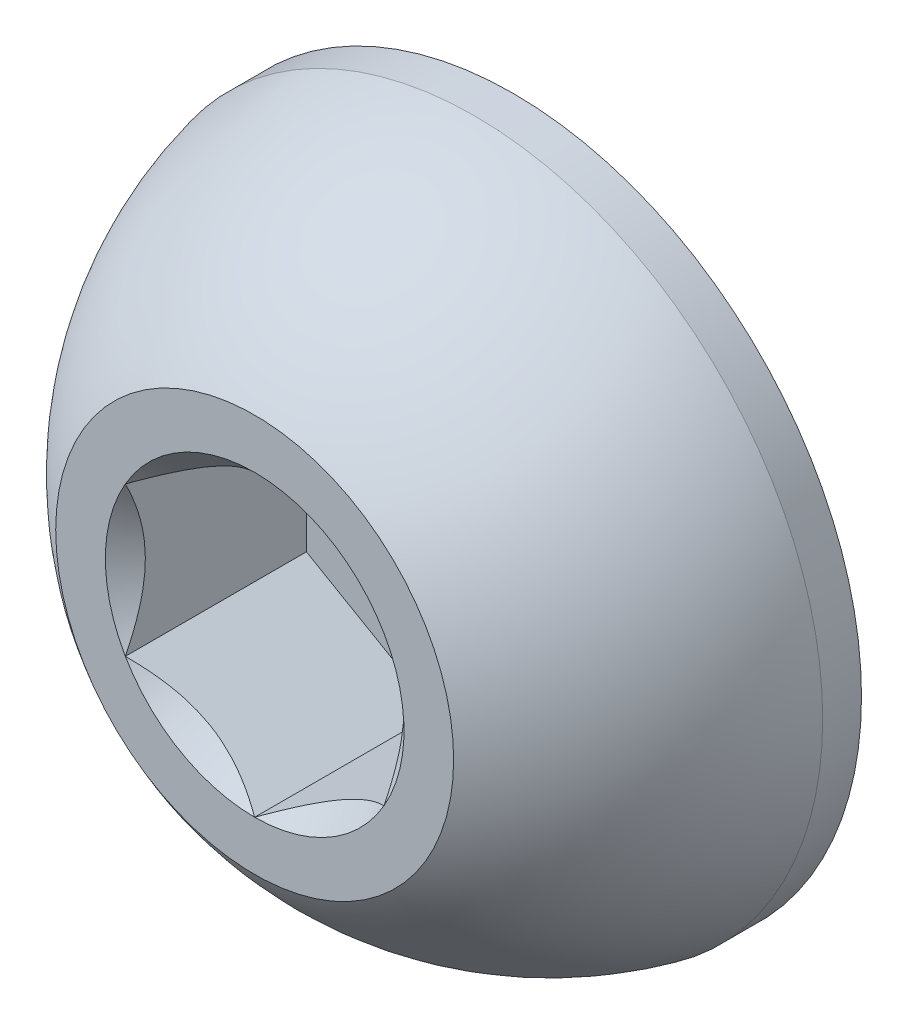
ISO-10303-21;
HEADER;
FILE_DESCRIPTION(('STEP AP214'),'2;1');
FILE_NAME('part.step','',(''),(''),'','','');
FILE_SCHEMA(('AUTOMOTIVE_DESIGN { 1 0 10303 214 1 1 1 1 }'));
ENDSEC;
DATA;
#1=APPLICATION_CONTEXT('core data for automotive mechanical design processes');
#2=APPLICATION_PROTOCOL_DEFINITION('international standard','automotive_design',2000,#1);
#3=PRODUCT_CONTEXT('',#1,'mechanical');
#4=PRODUCT('Part','Part','',(#3));
#5=PRODUCT_RELATED_PRODUCT_CATEGORY('part','',(#4));
#6=PRODUCT_DEFINITION_FORMATION('','',#4);
#7=PRODUCT_DEFINITION_CONTEXT('part definition',#1,'design');
#8=PRODUCT_DEFINITION('design','',#6,#7);
#9=PRODUCT_DEFINITION_SHAPE('','',#8);
#10=(LENGTH_UNIT() NAMED_UNIT(*) SI_UNIT(.MILLI.,.METRE.));
#11=(NAMED_UNIT(*) PLANE_ANGLE_UNIT() SI_UNIT($,.RADIAN.));
#12=(NAMED_UNIT(*) SI_UNIT($,.STERADIAN.) SOLID_ANGLE_UNIT());
#13=UNCERTAINTY_MEASURE_WITH_UNIT(LENGTH_MEASURE(1.E-05),#10,'distance_accuracy_value','');
#14=(GEOMETRIC_REPRESENTATION_CONTEXT(3) GLOBAL_UNCERTAINTY_ASSIGNED_CONTEXT((#13)) GLOBAL_UNIT_ASSIGNED_CONTEXT((#10,
#11,#12)) REPRESENTATION_CONTEXT('',''));
#15=CARTESIAN_POINT('',(0.,0.,0.));
#16=DIRECTION('',(0.,0.,1.));
#17=DIRECTION('',(1.,0.,0.));
#18=AXIS2_PLACEMENT_3D('',#15,#16,#17);
#19=CARTESIAN_POINT('',(0.,0.,-1.48575791855203));
#20=DIRECTION('',(0.,0.,1.));
#21=DIRECTION('',(0.,-1.,0.));
#22=AXIS2_PLACEMENT_3D('',#19,#20,#21);
#23=SPHERICAL_SURFACE('',#22,1.79094293391502);
#24=CARTESIAN_POINT('',(0.,0.,0.));
#25=DIRECTION('',(0.,0.,1.));
#26=DIRECTION('',(1.,0.,0.));
#27=AXIS2_PLACEMENT_3D('',#24,#25,#26);
#28=CIRCLE('',#27,1.00000000000001);
#29=CARTESIAN_POINT('',(1.00000000000001,0.,0.));
#30=VERTEX_POINT('',#29);
#31=EDGE_CURVE('E56',#30,#30,#28,.T.);
#32=ORIENTED_EDGE('',*,*,#31,.F.);
#33=EDGE_LOOP('',(#32));
#34=FACE_BOUND('',#33,.T.);
#35=CARTESIAN_POINT('',(0.,0.,-1.105));
#36=DIRECTION('',(0.,0.,1.));
#37=DIRECTION('',(1.,0.,0.));
#38=AXIS2_PLACEMENT_3D('',#35,#36,#37);
#39=CIRCLE('',#38,1.75);
#40=CARTESIAN_POINT('',(1.75,0.,-1.105));
#41=VERTEX_POINT('',#40);
#42=EDGE_CURVE('E170',#41,#41,#39,.T.);
#43=ORIENTED_EDGE('',*,*,#42,.T.);
#44=EDGE_LOOP('',(#43));
#45=FACE_BOUND('',#44,.T.);
#46=ADVANCED_FACE('F43',(#34,#45),#23,.T.);
#47=CARTESIAN_POINT('',(0.,-1.00000000000001,0.));
#48=DIRECTION('',(0.,0.,-1.));
#49=DIRECTION('',(-1.,0.,0.));
#50=AXIS2_PLACEMENT_3D('',#47,#48,#49);
#51=PLANE('',#50);
#52=CARTESIAN_POINT('',(0.,0.,0.));
#53=DIRECTION('',(0.,0.,1.));
#54=DIRECTION('',(1.,0.,0.));
#55=AXIS2_PLACEMENT_3D('',#52,#53,#54);
#56=CIRCLE('',#55,0.750555349946512);
#57=CARTESIAN_POINT('',(-0.649999999999998,0.375277674973256,0.));
#58=VERTEX_POINT('',#57);
#59=CARTESIAN_POINT('',(-0.649999999999997,-0.375277674973259,0.));
#60=VERTEX_POINT('',#59);
#61=EDGE_CURVE('E69',#58,#60,#56,.T.);
#62=ORIENTED_EDGE('',*,*,#61,.F.);
#63=CARTESIAN_POINT('',(0.,0.750555349946512,0.));
#64=VERTEX_POINT('',#63);
#65=EDGE_CURVE('E141',#64,#58,#56,.T.);
#66=ORIENTED_EDGE('',*,*,#65,.F.);
#67=CARTESIAN_POINT('',(0.65,0.375277674973254,0.));
#68=VERTEX_POINT('',#67);
#69=EDGE_CURVE('E138',#68,#64,#56,.T.);
#70=ORIENTED_EDGE('',*,*,#69,.F.);
#71=CARTESIAN_POINT('',(0.65,-0.375277674973254,0.));
#72=VERTEX_POINT('',#71);
#73=EDGE_CURVE('E109',#72,#68,#56,.T.);
#74=ORIENTED_EDGE('',*,*,#73,.F.);
#75=CARTESIAN_POINT('',(0.,-0.750555349946512,0.));
#76=VERTEX_POINT('',#75);
#77=EDGE_CURVE('E101',#76,#72,#56,.T.);
#78=ORIENTED_EDGE('',*,*,#77,.F.);
#79=EDGE_CURVE('E62',#60,#76,#56,.T.);
#80=ORIENTED_EDGE('',*,*,#79,.F.);
#81=EDGE_LOOP('',(#62,#66,#70,#74,#78,#80));
#82=FACE_BOUND('',#81,.T.);
#83=ORIENTED_EDGE('',*,*,#31,.T.);
#84=EDGE_LOOP('',(#83));
#85=FACE_BOUND('',#84,.T.);
#86=ADVANCED_FACE('F135',(#82,#85),#51,.F.);
#87=CARTESIAN_POINT('',(0.,-1.75,-1.3));
#88=DIRECTION('',(0.,0.,1.));
#89=DIRECTION('',(1.,0.,0.));
#90=AXIS2_PLACEMENT_3D('',#87,#88,#89);
#91=PLANE('',#90);
#92=CARTESIAN_POINT('',(0.,0.,-1.3));
#93=DIRECTION('',(0.,0.,1.));
#94=DIRECTION('',(1.,0.,0.));
#95=AXIS2_PLACEMENT_3D('',#92,#93,#94);
#96=CIRCLE('',#95,1.75);
#97=CARTESIAN_POINT('',(1.75,0.,-1.3));
#98=VERTEX_POINT('',#97);
#99=EDGE_CURVE('E173',#98,#98,#96,.T.);
#100=ORIENTED_EDGE('',*,*,#99,.F.);
#101=EDGE_LOOP('',(#100));
#102=FACE_BOUND('',#101,.T.);
#103=ADVANCED_FACE('F185',(#102),#91,.F.);
#104=CARTESIAN_POINT('',(0.,0.,0.));
#105=DIRECTION('',(0.,0.,1.));
#106=DIRECTION('',(1.,0.,0.));
#107=AXIS2_PLACEMENT_3D('',#104,#105,#106);
#108=CYLINDRICAL_SURFACE('',#107,1.75);
#109=ORIENTED_EDGE('',*,*,#42,.F.);
#110=EDGE_LOOP('',(#109));
#111=FACE_BOUND('',#110,.T.);
#112=ORIENTED_EDGE('',*,*,#99,.T.);
#113=EDGE_LOOP('',(#112));
#114=FACE_BOUND('',#113,.T.);
#115=ADVANCED_FACE('F182',(#111,#114),#108,.T.);
#116=CARTESIAN_POINT('',(0.,0.,0.));
#117=DIRECTION('',(0.,0.,1.));
#118=DIRECTION('',(1.,0.,0.));
#119=AXIS2_PLACEMENT_3D('',#116,#117,#118);
#120=CONICAL_SURFACE('',#119,0.750555349946512,0.78539816339745);
#121=ORIENTED_EDGE('',*,*,#73,.T.);
#122=CARTESIAN_POINT('',(0.65,-0.748456856201993,0.240750690384005));
#123=CARTESIAN_POINT('',(0.65,-0.711991073878816,0.213280285933621));
#124=CARTESIAN_POINT('',(0.65,-0.675139640082794,0.186265195476194));
#125=CARTESIAN_POINT('',(0.65,-0.600031183452819,0.133629348283163));
#126=CARTESIAN_POINT('',(0.65,-0.561765441270894,0.108021106129097));
#127=CARTESIAN_POINT('',(0.65,-0.481525479406319,0.0577374937624613));
#128=CARTESIAN_POINT('',(0.65,-0.439464253670484,0.0331988021987558));
#129=CARTESIAN_POINT('',(0.65,-0.353242719412717,-0.0116853403013637));
#130=CARTESIAN_POINT('',(0.65,-0.309090130602523,-0.0320449275105113));
#131=CARTESIAN_POINT('',(0.65,-0.242810057498668,-0.0569512709113473));
#132=CARTESIAN_POINT('',(0.65,-0.221667349821687,-0.0640992725852869));
#133=CARTESIAN_POINT('',(0.65,-0.178882845085541,-0.0767024705474531));
#134=CARTESIAN_POINT('',(0.65,-0.157241013753962,-0.0821575502168733));
#135=CARTESIAN_POINT('',(0.65,-0.0924732258239327,-0.0953392346897749));
#136=CARTESIAN_POINT('',(0.65,-0.0486986201802761,-0.100206440230559));
#137=CARTESIAN_POINT('',(0.65,0.0373331587621249,-0.10085551076922));
#138=CARTESIAN_POINT('',(0.65,0.0795879418799275,-0.0969596606801929));
#139=CARTESIAN_POINT('',(0.65,0.142230570834976,-0.0855076744021655));
#140=CARTESIAN_POINT('',(0.65,0.163174856664669,-0.080685435763269));
#141=CARTESIAN_POINT('',(0.65,0.204615212735414,-0.0693999000452562));
#142=CARTESIAN_POINT('',(0.65,0.225111320324617,-0.0629367402798553));
#143=CARTESIAN_POINT('',(0.65,0.289638534772371,-0.0401559078683569));
#144=CARTESIAN_POINT('',(0.65,0.332748206875051,-0.0212427548657985));
#145=CARTESIAN_POINT('',(0.65,0.416943840013234,0.0208112818887808));
#146=CARTESIAN_POINT('',(0.65,0.45802183453077,0.0439673547577785));
#147=CARTESIAN_POINT('',(0.65,0.53652923324599,0.0917266397180912));
#148=CARTESIAN_POINT('',(0.65,0.574038509134623,0.116200758127156));
#149=CARTESIAN_POINT('',(0.65,0.647609691485458,0.166623456014885));
#150=CARTESIAN_POINT('',(0.65,0.683680924535921,0.192558343655291));
#151=CARTESIAN_POINT('',(0.65,0.719356204751142,0.218966877397434));
#152=B_SPLINE_CURVE_WITH_KNOTS('',3,(#122,#123,#124,#125,#126,#127,#128,#129,#130,#131,#132,
#133,#134,#135,#136,#137,#138,#139,#140,#141,#142,#143,#144,#145,#146,#147,#148,#149,#150,#151),
.UNSPECIFIED.,.F.,.F.,(4,2,2,2,2,2,2,2,2,2,2,2,2,2,4),(0.,0.137014030009578,0.275096405762551,
0.421060359835522,0.566522128775089,0.633415056462916,0.7003125911218,0.831534924508334,
0.958010408789896,1.02242898521265,1.08684217280828,1.22766018796412,1.36899252873703,
1.50330165960873,1.63651263433843),.UNSPECIFIED.);
#153=EDGE_CURVE('E11',#72,#68,#152,.T.);
#154=ORIENTED_EDGE('',*,*,#153,.F.);
#155=EDGE_LOOP('',(#121,#154));
#156=FACE_BOUND('',#155,.T.);
#157=ADVANCED_FACE('F113',(#156),#120,.F.);
#158=ORIENTED_EDGE('',*,*,#69,.T.);
#159=CARTESIAN_POINT('',(0.6502,0.375162204919418,0.000115496696675192));
#160=CARTESIAN_POINT('',(0.62784612455738,0.388068220923646,-0.0127826378084528));
#161=CARTESIAN_POINT('',(0.605119879467388,0.401189224644023,-0.0249248451013623));
#162=CARTESIAN_POINT('',(0.558778015356718,0.427944712363067,-0.0471577551377729));
#163=CARTESIAN_POINT('',(0.535157980959404,0.441581745580624,-0.0572360751899923));
#164=CARTESIAN_POINT('',(0.487526191293144,0.469081972166423,-0.0744984835766245));
#165=CARTESIAN_POINT('',(0.463526635406914,0.482938122217769,-0.08172604148442));
#166=CARTESIAN_POINT('',(0.415010589754791,0.510948874235039,-0.0928707979999926));
#167=CARTESIAN_POINT('',(0.390495555958119,0.52510263559674,-0.0967962973781314));
#168=CARTESIAN_POINT('',(0.33061559766408,0.559674345636867,-0.101776562665292));
#169=CARTESIAN_POINT('',(0.295110807096765,0.580173046028428,-0.100875515207341));
#170=CARTESIAN_POINT('',(0.224845447682006,0.620740770201245,-0.0915914386833307));
#171=CARTESIAN_POINT('',(0.190086069560699,0.640809106516445,-0.083197236970343));
#172=CARTESIAN_POINT('',(0.129041737491061,0.676053068069352,-0.0629543214927018));
#173=CARTESIAN_POINT('',(0.102476138584915,0.691390723748998,-0.0521615767354971));
#174=CARTESIAN_POINT('',(0.0503858451009338,0.721465068714142,-0.0278480685503981));
#175=CARTESIAN_POINT('',(0.0248580811749648,0.736203530088609,-0.0143361789927107));
#176=CARTESIAN_POINT('',(-0.000199999999999354,0.75067082000035,0.000115496696673986));
#177=B_SPLINE_CURVE_WITH_KNOTS('',3,(#159,#160,#161,#162,#163,#164,#165,#166,#167,#168,#169,
#170,#171,#172,#173,#174,#175,#176),.UNSPECIFIED.,.F.,.F.,(4,2,2,2,2,2,2,2,4),(0.,
0.0866236559063445,0.173752711623243,0.259496442803569,0.345023980281753,0.467267720550126,
0.589694037029336,0.687111308755481,0.784215671813665),.UNSPECIFIED.);
#178=EDGE_CURVE('E140',#68,#64,#177,.T.);
#179=ORIENTED_EDGE('',*,*,#178,.F.);
#180=EDGE_LOOP('',(#158,#179));
#181=FACE_BOUND('',#180,.T.);
#182=ADVANCED_FACE('F275',(#181),#120,.F.);
#183=ORIENTED_EDGE('',*,*,#65,.T.);
#184=CARTESIAN_POINT('',(0.000200000000000687,0.75067082000035,0.000115496696674086));
#185=CARTESIAN_POINT('',(-0.0221538754426199,0.737764803996122,-0.0127826378084537));
#186=CARTESIAN_POINT('',(-0.0448801205326119,0.724643800275746,-0.0249248451013632));
#187=CARTESIAN_POINT('',(-0.0912219846432817,0.697888312556701,-0.0471577551377739));
#188=CARTESIAN_POINT('',(-0.114842019040596,0.684251279339144,-0.0572360751899933));
#189=CARTESIAN_POINT('',(-0.162473808706855,0.656751052753345,-0.0744984835766254));
#190=CARTESIAN_POINT('',(-0.186473364593085,0.642894902701999,-0.0817260414844208));
#191=CARTESIAN_POINT('',(-0.234989410245209,0.614884150684729,-0.0928707979999933));
#192=CARTESIAN_POINT('',(-0.25950444404188,0.600730389323028,-0.0967962973781321));
#193=CARTESIAN_POINT('',(-0.319384402335919,0.566158679282901,-0.101776562665293));
#194=CARTESIAN_POINT('',(-0.354889192903234,0.545659978891341,-0.100875515207342));
#195=CARTESIAN_POINT('',(-0.425154552317993,0.505092254718524,-0.0915914386833313));
#196=CARTESIAN_POINT('',(-0.4599139304393,0.485023918403323,-0.0831972369703435));
#197=CARTESIAN_POINT('',(-0.520958262508938,0.449779956850417,-0.0629543214927024));
#198=CARTESIAN_POINT('',(-0.547523861415084,0.43444230117077,-0.0521615767354977));
#199=CARTESIAN_POINT('',(-0.599614154899065,0.404367956205627,-0.0278480685503987));
#200=CARTESIAN_POINT('',(-0.625141918825034,0.389629494831159,-0.0143361789927112));
#201=CARTESIAN_POINT('',(-0.650199999999998,0.375162204919418,0.0001154966966736));
#202=B_SPLINE_CURVE_WITH_KNOTS('',3,(#184,#185,#186,#187,#188,#189,#190,#191,#192,#193,#194,
#195,#196,#197,#198,#199,#200,#201),.UNSPECIFIED.,.F.,.F.,(4,2,2,2,2,2,2,2,4),(0.,
0.0866236559063444,0.173752711623242,0.259496442803568,0.345023980281752,0.467267720550125,
0.589694037029335,0.68711130875548,0.784215671813665),.UNSPECIFIED.);
#203=EDGE_CURVE('E145',#64,#58,#202,.T.);
#204=ORIENTED_EDGE('',*,*,#203,.F.);
#205=EDGE_LOOP('',(#183,#204));
#206=FACE_BOUND('',#205,.T.);
#207=ADVANCED_FACE('F148',(#206),#120,.F.);
#208=ORIENTED_EDGE('',*,*,#61,.T.);
#209=CARTESIAN_POINT('',(-0.649999999999997,-0.748456856202,0.240750690384008));
#210=CARTESIAN_POINT('',(-0.649999999999997,-0.711991073878822,0.213280285933623));
#211=CARTESIAN_POINT('',(-0.649999999999997,-0.6751396400828,0.186265195476196));
#212=CARTESIAN_POINT('',(-0.649999999999997,-0.600031183452825,0.133629348283164));
#213=CARTESIAN_POINT('',(-0.649999999999997,-0.561765441270899,0.108021106129098));
#214=CARTESIAN_POINT('',(-0.649999999999997,-0.481525479406324,0.0577374937624617));
#215=CARTESIAN_POINT('',(-0.649999999999997,-0.439464253670489,0.0331988021987558));
#216=CARTESIAN_POINT('',(-0.649999999999997,-0.353242719412722,-0.0116853403013644));
#217=CARTESIAN_POINT('',(-0.649999999999997,-0.309090130602527,-0.0320449275105122));
#218=CARTESIAN_POINT('',(-0.649999999999997,-0.242810057498671,-0.0569512709113487));
#219=CARTESIAN_POINT('',(-0.649999999999998,-0.221667349821691,-0.0640992725852885));
#220=CARTESIAN_POINT('',(-0.649999999999998,-0.178882845085544,-0.076702470547455));
#221=CARTESIAN_POINT('',(-0.649999999999998,-0.157241013753965,-0.0821575502168752));
#222=CARTESIAN_POINT('',(-0.649999999999998,-0.092473225823936,-0.0953392346897771));
#223=CARTESIAN_POINT('',(-0.649999999999998,-0.0486986201802792,-0.100206440230561));
#224=CARTESIAN_POINT('',(-0.649999999999998,0.0373331587621221,-0.100855510769223));
#225=CARTESIAN_POINT('',(-0.649999999999998,0.0795879418799249,-0.0969596606801957));
#226=CARTESIAN_POINT('',(-0.649999999999998,0.142230570834973,-0.0855076744021684));
#227=CARTESIAN_POINT('',(-0.649999999999998,0.163174856664667,-0.080685435763272));
#228=CARTESIAN_POINT('',(-0.649999999999998,0.204615212735411,-0.0693999000452592));
#229=CARTESIAN_POINT('',(-0.649999999999998,0.225111320324615,-0.0629367402798583));
#230=CARTESIAN_POINT('',(-0.649999999999998,0.289638534772368,-0.0401559078683601));
#231=CARTESIAN_POINT('',(-0.649999999999998,0.332748206875048,-0.0212427548658018));
#232=CARTESIAN_POINT('',(-0.649999999999998,0.41694384001323,0.0208112818887772));
#233=CARTESIAN_POINT('',(-0.649999999999998,0.458021834530766,0.0439673547577745));
#234=CARTESIAN_POINT('',(-0.649999999999998,0.536529233245986,0.0917266397180868));
#235=CARTESIAN_POINT('',(-0.649999999999998,0.574038509134618,0.116200758127151));
#236=CARTESIAN_POINT('',(-0.649999999999999,0.647609691485453,0.166623456014881));
#237=CARTESIAN_POINT('',(-0.649999999999999,0.683680924535915,0.192558343655286));
#238=CARTESIAN_POINT('',(-0.649999999999999,0.719356204751137,0.218966877397429));
#239=B_SPLINE_CURVE_WITH_KNOTS('',3,(#209,#210,#211,#212,#213,#214,#215,#216,#217,#218,#219,
#220,#221,#222,#223,#224,#225,#226,#227,#228,#229,#230,#231,#232,#233,#234,#235,#236,#237,#238),
.UNSPECIFIED.,.F.,.F.,(4,2,2,2,2,2,2,2,2,2,2,2,2,2,4),(0.,0.13701403000958,0.275096405762553,
0.421060359835525,0.566522128775094,0.633415056462921,0.700312591121805,0.83153492450834,
0.958010408789902,1.02242898521266,1.08684217280828,1.22766018796413,1.36899252873703,
1.50330165960873,1.63651263433843),.UNSPECIFIED.);
#240=EDGE_CURVE('E152',#58,#60,#239,.F.);
#241=ORIENTED_EDGE('',*,*,#240,.F.);
#242=EDGE_LOOP('',(#208,#241));
#243=FACE_BOUND('',#242,.T.);
#244=ADVANCED_FACE('F269',(#243),#120,.F.);
#245=ORIENTED_EDGE('',*,*,#79,.T.);
#246=CARTESIAN_POINT('',(-0.650199999999997,-0.375162204919418,0.000115496696672807));
#247=CARTESIAN_POINT('',(-0.627846124557377,-0.388068220923647,-0.0127826378084549));
#248=CARTESIAN_POINT('',(-0.605119879467385,-0.401189224644023,-0.0249248451013643));
#249=CARTESIAN_POINT('',(-0.558778015356716,-0.427944712363067,-0.0471577551377746));
#250=CARTESIAN_POINT('',(-0.535157980959402,-0.441581745580625,-0.0572360751899938));
#251=CARTESIAN_POINT('',(-0.487526191293143,-0.469081972166423,-0.0744984835766257));
#252=CARTESIAN_POINT('',(-0.463526635406913,-0.482938122217769,-0.081726041484421));
#253=CARTESIAN_POINT('',(-0.41501058975479,-0.510948874235039,-0.0928707979999934));
#254=CARTESIAN_POINT('',(-0.390495555958118,-0.52510263559674,-0.096796297378132));
#255=CARTESIAN_POINT('',(-0.33061559766408,-0.559674345636867,-0.101776562665293));
#256=CARTESIAN_POINT('',(-0.295110807096765,-0.580173046028428,-0.100875515207342));
#257=CARTESIAN_POINT('',(-0.224845447682006,-0.620740770201245,-0.0915914386833309));
#258=CARTESIAN_POINT('',(-0.190086069560699,-0.640809106516445,-0.0831972369703432));
#259=CARTESIAN_POINT('',(-0.129041737491061,-0.676053068069351,-0.062954321492702));
#260=CARTESIAN_POINT('',(-0.102476138584916,-0.691390723748998,-0.0521615767354973));
#261=CARTESIAN_POINT('',(-0.0503858451009351,-0.721465068714141,-0.0278480685503986));
#262=CARTESIAN_POINT('',(-0.0248580811749664,-0.736203530088608,-0.0143361789927113));
#263=CARTESIAN_POINT('',(0.00019999999999743,-0.750670820000349,0.000115496696673118));
#264=B_SPLINE_CURVE_WITH_KNOTS('',3,(#246,#247,#248,#249,#250,#251,#252,#253,#254,#255,#256,
#257,#258,#259,#260,#261,#262,#263),.UNSPECIFIED.,.F.,.F.,(4,2,2,2,2,2,2,2,4),(0.,
0.0866236559063438,0.173752711623241,0.259496442803566,0.34502398028175,0.467267720550123,
0.589694037029333,0.687111308755476,0.78421567181366),.UNSPECIFIED.);
#265=EDGE_CURVE('E125',#60,#76,#264,.T.);
#266=ORIENTED_EDGE('',*,*,#265,.F.);
#267=EDGE_LOOP('',(#245,#266));
#268=FACE_BOUND('',#267,.T.);
#269=ADVANCED_FACE('F217',(#268),#120,.F.);
#270=ORIENTED_EDGE('',*,*,#77,.T.);
#271=CARTESIAN_POINT('',(-0.000200000000002532,-0.750670820000349,0.000115496696673219));
#272=CARTESIAN_POINT('',(0.0221538754426182,-0.737764803996121,-0.0127826378084547));
#273=CARTESIAN_POINT('',(0.0448801205326102,-0.724643800275745,-0.0249248451013643));
#274=CARTESIAN_POINT('',(0.0912219846432802,-0.6978883125567,-0.0471577551377752));
#275=CARTESIAN_POINT('',(0.114842019040594,-0.684251279339143,-0.0572360751899947));
#276=CARTESIAN_POINT('',(0.162473808706854,-0.656751052753344,-0.074498483576627));
#277=CARTESIAN_POINT('',(0.186473364593084,-0.642894902701998,-0.0817260414844226));
#278=CARTESIAN_POINT('',(0.234989410245208,-0.614884150684728,-0.0928707979999952));
#279=CARTESIAN_POINT('',(0.259504444041879,-0.600730389323027,-0.0967962973781341));
#280=CARTESIAN_POINT('',(0.319384402335918,-0.5661586792829,-0.101776562665295));
#281=CARTESIAN_POINT('',(0.354889192903233,-0.545659978891339,-0.100875515207344));
#282=CARTESIAN_POINT('',(0.425154552317992,-0.505092254718522,-0.0915914386833333));
#283=CARTESIAN_POINT('',(0.459913930439299,-0.485023918403322,-0.0831972369703457));
#284=CARTESIAN_POINT('',(0.520958262508937,-0.449779956850415,-0.0629543214927043));
#285=CARTESIAN_POINT('',(0.547523861415084,-0.434442301170768,-0.0521615767354993));
#286=CARTESIAN_POINT('',(0.599614154899066,-0.404367956205624,-0.0278480685503996));
#287=CARTESIAN_POINT('',(0.625141918825036,-0.389629494831156,-0.0143361789927117));
#288=CARTESIAN_POINT('',(0.6502,-0.375162204919414,0.000115496696673408));
#289=B_SPLINE_CURVE_WITH_KNOTS('',3,(#271,#272,#273,#274,#275,#276,#277,#278,#279,#280,#281,
#282,#283,#284,#285,#286,#287,#288),.UNSPECIFIED.,.F.,.F.,(4,2,2,2,2,2,2,2,4),(0.,
0.0866236559063447,0.173752711623243,0.259496442803569,0.345023980281754,0.467267720550126,
0.589694037029336,0.687111308755483,0.78421567181367),.UNSPECIFIED.);
#290=EDGE_CURVE('E105',#76,#72,#289,.T.);
#291=ORIENTED_EDGE('',*,*,#290,.F.);
#292=EDGE_LOOP('',(#270,#291));
#293=FACE_BOUND('',#292,.T.);
#294=ADVANCED_FACE('F103',(#293),#120,.F.);
#295=CARTESIAN_POINT('',(0.65,-0.375277674973252,-0.91));
#296=DIRECTION('',(0.,0.,1.));
#297=DIRECTION('',(1.,0.,0.));
#298=AXIS2_PLACEMENT_3D('',#295,#296,#297);
#299=PLANE('',#298);
#300=DIRECTION('',(0.866025403784438,0.5,0.));
#301=VECTOR('',#300,1.);
#302=CARTESIAN_POINT('',(0.,-0.750555349946511,-0.91));
#303=LINE('',#302,#301);
#304=CARTESIAN_POINT('',(0.,-0.750555349946511,-0.91));
#305=VERTEX_POINT('',#304);
#306=CARTESIAN_POINT('',(0.65,-0.375277674973252,-0.91));
#307=VERTEX_POINT('',#306);
#308=EDGE_CURVE('E124',#305,#307,#303,.T.);
#309=ORIENTED_EDGE('',*,*,#308,.T.);
#310=DIRECTION('',(0.,1.,0.));
#311=VECTOR('',#310,1.);
#312=CARTESIAN_POINT('',(0.65,-0.375277674973252,-0.91));
#313=LINE('',#312,#311);
#314=CARTESIAN_POINT('',(0.65,0.375277674973256,-0.91));
#315=VERTEX_POINT('',#314);
#316=EDGE_CURVE('E129',#307,#315,#313,.T.);
#317=ORIENTED_EDGE('',*,*,#316,.T.);
#318=DIRECTION('',(-0.866025403784439,0.5,0.));
#319=VECTOR('',#318,1.);
#320=CARTESIAN_POINT('',(0.65,0.375277674973256,-0.91));
#321=LINE('',#320,#319);
#322=CARTESIAN_POINT('',(0.,0.750555349946512,-0.91));
#323=VERTEX_POINT('',#322);
#324=EDGE_CURVE('E259',#315,#323,#321,.T.);
#325=ORIENTED_EDGE('',*,*,#324,.T.);
#326=DIRECTION('',(-0.866025403784439,-0.5,0.));
#327=VECTOR('',#326,1.);
#328=CARTESIAN_POINT('',(0.,0.750555349946512,-0.91));
#329=LINE('',#328,#327);
#330=CARTESIAN_POINT('',(-0.649999999999998,0.375277674973256,-0.91));
#331=VERTEX_POINT('',#330);
#332=EDGE_CURVE('E161',#323,#331,#329,.T.);
#333=ORIENTED_EDGE('',*,*,#332,.T.);
#334=DIRECTION('',(0.,-1.,0.));
#335=VECTOR('',#334,1.);
#336=CARTESIAN_POINT('',(-0.649999999999998,0.375277674973256,-0.91));
#337=LINE('',#336,#335);
#338=CARTESIAN_POINT('',(-0.649999999999997,-0.375277674973256,-0.91));
#339=VERTEX_POINT('',#338);
#340=EDGE_CURVE('E263',#331,#339,#337,.T.);
#341=ORIENTED_EDGE('',*,*,#340,.T.);
#342=DIRECTION('',(0.866025403784438,-0.500000000000001,0.));
#343=VECTOR('',#342,1.);
#344=CARTESIAN_POINT('',(-0.649999999999997,-0.375277674973256,-0.91));
#345=LINE('',#344,#343);
#346=EDGE_CURVE('E132',#339,#305,#345,.T.);
#347=ORIENTED_EDGE('',*,*,#346,.T.);
#348=EDGE_LOOP('',(#309,#317,#325,#333,#341,#347));
#349=FACE_BOUND('',#348,.T.);
#350=ADVANCED_FACE('F216',(#349),#299,.T.);
#351=CARTESIAN_POINT('',(0.65,-0.375277674973252,-0.91));
#352=DIRECTION('',(1.,0.,0.));
#353=DIRECTION('',(0.,0.,-1.));
#354=AXIS2_PLACEMENT_3D('',#351,#352,#353);
#355=PLANE('',#354);
#356=DIRECTION('',(0.,0.,1.));
#357=VECTOR('',#356,1.);
#358=CARTESIAN_POINT('',(0.65,-0.375277674973252,-0.91));
#359=LINE('',#358,#357);
#360=EDGE_CURVE('E121',#307,#72,#359,.T.);
#361=ORIENTED_EDGE('',*,*,#360,.T.);
#362=ORIENTED_EDGE('',*,*,#153,.T.);
#363=DIRECTION('',(0.,0.,1.));
#364=VECTOR('',#363,1.);
#365=CARTESIAN_POINT('',(0.65,0.375277674973256,-0.91));
#366=LINE('',#365,#364);
#367=EDGE_CURVE('E131',#315,#68,#366,.T.);
#368=ORIENTED_EDGE('',*,*,#367,.F.);
#369=ORIENTED_EDGE('',*,*,#316,.F.);
#370=EDGE_LOOP('',(#361,#362,#368,#369));
#371=FACE_BOUND('',#370,.T.);
#372=ADVANCED_FACE('F127',(#371),#355,.F.);
#373=CARTESIAN_POINT('',(0.65,0.375277674973256,-0.91));
#374=DIRECTION('',(0.5,0.866025403784439,0.));
#375=DIRECTION('',(-0.866025403784439,0.5,0.));
#376=AXIS2_PLACEMENT_3D('',#373,#374,#375);
#377=PLANE('',#376);
#378=ORIENTED_EDGE('',*,*,#367,.T.);
#379=ORIENTED_EDGE('',*,*,#178,.T.);
#380=DIRECTION('',(0.,0.,1.));
#381=VECTOR('',#380,1.);
#382=CARTESIAN_POINT('',(0.,0.750555349946512,-0.91));
#383=LINE('',#382,#381);
#384=EDGE_CURVE('E157',#323,#64,#383,.T.);
#385=ORIENTED_EDGE('',*,*,#384,.F.);
#386=ORIENTED_EDGE('',*,*,#324,.F.);
#387=EDGE_LOOP('',(#378,#379,#385,#386));
#388=FACE_BOUND('',#387,.T.);
#389=ADVANCED_FACE('F155',(#388),#377,.F.);
#390=CARTESIAN_POINT('',(0.,0.750555349946512,-0.91));
#391=DIRECTION('',(-0.5,0.866025403784439,0.));
#392=DIRECTION('',(-0.866025403784439,-0.5,0.));
#393=AXIS2_PLACEMENT_3D('',#390,#391,#392);
#394=PLANE('',#393);
#395=ORIENTED_EDGE('',*,*,#384,.T.);
#396=ORIENTED_EDGE('',*,*,#203,.T.);
#397=DIRECTION('',(0.,0.,1.));
#398=VECTOR('',#397,1.);
#399=CARTESIAN_POINT('',(-0.649999999999998,0.375277674973256,-0.91));
#400=LINE('',#399,#398);
#401=EDGE_CURVE('E163',#331,#58,#400,.T.);
#402=ORIENTED_EDGE('',*,*,#401,.F.);
#403=ORIENTED_EDGE('',*,*,#332,.F.);
#404=EDGE_LOOP('',(#395,#396,#402,#403));
#405=FACE_BOUND('',#404,.T.);
#406=ADVANCED_FACE('F159',(#405),#394,.F.);
#407=CARTESIAN_POINT('',(-0.649999999999998,0.375277674973256,-0.91));
#408=DIRECTION('',(-1.,0.,0.));
#409=DIRECTION('',(0.,-1.,0.));
#410=AXIS2_PLACEMENT_3D('',#407,#408,#409);
#411=PLANE('',#410);
#412=ORIENTED_EDGE('',*,*,#401,.T.);
#413=ORIENTED_EDGE('',*,*,#240,.T.);
#414=DIRECTION('',(0.,0.,1.));
#415=VECTOR('',#414,1.);
#416=CARTESIAN_POINT('',(-0.649999999999997,-0.375277674973256,-0.91));
#417=LINE('',#416,#415);
#418=EDGE_CURVE('E165',#339,#60,#417,.T.);
#419=ORIENTED_EDGE('',*,*,#418,.F.);
#420=ORIENTED_EDGE('',*,*,#340,.F.);
#421=EDGE_LOOP('',(#412,#413,#419,#420));
#422=FACE_BOUND('',#421,.T.);
#423=ADVANCED_FACE('F238',(#422),#411,.F.);
#424=CARTESIAN_POINT('',(-0.649999999999997,-0.375277674973256,-0.91));
#425=DIRECTION('',(-0.500000000000001,-0.866025403784438,0.));
#426=DIRECTION('',(0.866025403784438,-0.500000000000001,0.));
#427=AXIS2_PLACEMENT_3D('',#424,#425,#426);
#428=PLANE('',#427);
#429=ORIENTED_EDGE('',*,*,#418,.T.);
#430=ORIENTED_EDGE('',*,*,#265,.T.);
#431=DIRECTION('',(0.,0.,1.));
#432=VECTOR('',#431,1.);
#433=CARTESIAN_POINT('',(0.,-0.750555349946511,-0.91));
#434=LINE('',#433,#432);
#435=EDGE_CURVE('E123',#305,#76,#434,.T.);
#436=ORIENTED_EDGE('',*,*,#435,.F.);
#437=ORIENTED_EDGE('',*,*,#346,.F.);
#438=EDGE_LOOP('',(#429,#430,#436,#437));
#439=FACE_BOUND('',#438,.T.);
#440=ADVANCED_FACE('F197',(#439),#428,.F.);
#441=CARTESIAN_POINT('',(0.,-0.750555349946511,-0.91));
#442=DIRECTION('',(0.500000000000001,-0.866025403784438,0.));
#443=DIRECTION('',(0.866025403784438,0.500000000000001,0.));
#444=AXIS2_PLACEMENT_3D('',#441,#442,#443);
#445=PLANE('',#444);
#446=ORIENTED_EDGE('',*,*,#435,.T.);
#447=ORIENTED_EDGE('',*,*,#290,.T.);
#448=ORIENTED_EDGE('',*,*,#360,.F.);
#449=ORIENTED_EDGE('',*,*,#308,.F.);
#450=EDGE_LOOP('',(#446,#447,#448,#449));
#451=FACE_BOUND('',#450,.T.);
#452=ADVANCED_FACE('F119',(#451),#445,.F.);
#453=CLOSED_SHELL('',(#46,#86,#103,#115,#157,#182,#207,#244,#269,#294,#350,#372,#389,#406,#423,
#440,#452));
#454=MANIFOLD_SOLID_BREP('B2',#453);
#455=ADVANCED_BREP_SHAPE_REPRESENTATION('',(#18,#454),#14);
#456=SHAPE_DEFINITION_REPRESENTATION(#9,#455);
ENDSEC;
END-ISO-10303-21;
